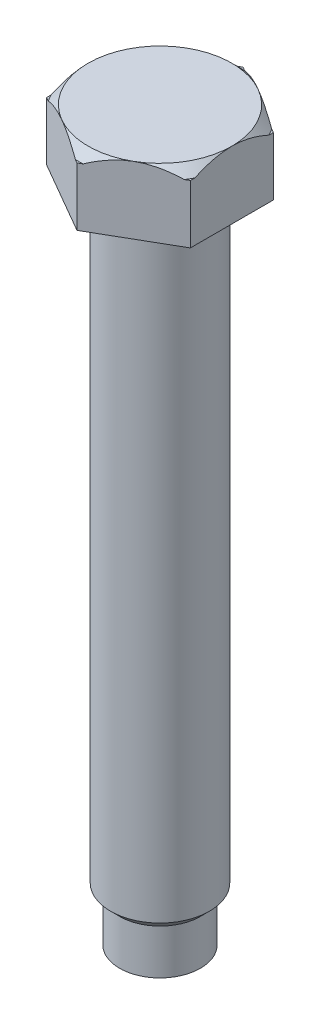
ISO-10303-21;
HEADER;
FILE_DESCRIPTION(('STEP AP214'),'2;1');
FILE_NAME('part.step','',(''),(''),'','','');
FILE_SCHEMA(('AUTOMOTIVE_DESIGN { 1 0 10303 214 1 1 1 1 }'));
ENDSEC;
DATA;
#1=APPLICATION_CONTEXT('core data for automotive mechanical design processes');
#2=APPLICATION_PROTOCOL_DEFINITION('international standard','automotive_design',2000,#1);
#3=PRODUCT_CONTEXT('',#1,'mechanical');
#4=PRODUCT('Part','Part','',(#3));
#5=PRODUCT_RELATED_PRODUCT_CATEGORY('part','',(#4));
#6=PRODUCT_DEFINITION_FORMATION('','',#4);
#7=PRODUCT_DEFINITION_CONTEXT('part definition',#1,'design');
#8=PRODUCT_DEFINITION('design','',#6,#7);
#9=PRODUCT_DEFINITION_SHAPE('','',#8);
#10=(LENGTH_UNIT() NAMED_UNIT(*) SI_UNIT(.MILLI.,.METRE.));
#11=(NAMED_UNIT(*) PLANE_ANGLE_UNIT() SI_UNIT($,.RADIAN.));
#12=(NAMED_UNIT(*) SI_UNIT($,.STERADIAN.) SOLID_ANGLE_UNIT());
#13=UNCERTAINTY_MEASURE_WITH_UNIT(LENGTH_MEASURE(1.E-05),#10,'distance_accuracy_value','');
#14=(GEOMETRIC_REPRESENTATION_CONTEXT(3) GLOBAL_UNCERTAINTY_ASSIGNED_CONTEXT((#13)) GLOBAL_UNIT_ASSIGNED_CONTEXT((#10,
#11,#12)) REPRESENTATION_CONTEXT('',''));
#15=CARTESIAN_POINT('',(0.,0.,0.));
#16=DIRECTION('',(0.,0.,1.));
#17=DIRECTION('',(1.,0.,0.));
#18=AXIS2_PLACEMENT_3D('',#15,#16,#17);
#19=CARTESIAN_POINT('',(-7.99999999999973,81.0000000000001,4.61880215351716));
#20=DIRECTION('',(0.500000000000007,0.,-0.866025403784446));
#21=DIRECTION('',(-0.866025403784441,0.,-0.500000000000008));
#22=AXIS2_PLACEMENT_3D('',#19,#20,#21);
#23=PLANE('',#22);
#24=DIRECTION('',(0.866025403784441,0.,0.500000000000008));
#25=VECTOR('',#24,1.);
#26=CARTESIAN_POINT('',(-7.9999999999997,80.0000000000001,4.61880215351725));
#27=LINE('',#26,#25);
#28=CARTESIAN_POINT('',(-7.9999999999997,80.0000000000001,4.61880215351725));
#29=VERTEX_POINT('',#28);
#30=CARTESIAN_POINT('',(-7.57071421427136,80.0000000000003,4.8666504174669));
#31=VERTEX_POINT('',#30);
#32=EDGE_CURVE('E322',#29,#31,#27,.T.);
#33=ORIENTED_EDGE('',*,*,#32,.F.);
#34=DIRECTION('',(0.,-1.,0.));
#35=VECTOR('',#34,1.);
#36=CARTESIAN_POINT('',(-7.99999999999973,81.0000000000001,4.61880215351716));
#37=LINE('',#36,#35);
#38=CARTESIAN_POINT('',(-7.9999999999997,73.5,4.61880215351713));
#39=VERTEX_POINT('',#38);
#40=EDGE_CURVE('E325',#29,#39,#37,.T.);
#41=ORIENTED_EDGE('',*,*,#40,.T.);
#42=DIRECTION('',(-0.866025403784441,0.,-0.500000000000008));
#43=VECTOR('',#42,1.);
#44=CARTESIAN_POINT('',(-7.9999999999997,73.5,4.61880215351713));
#45=LINE('',#44,#43);
#46=CARTESIAN_POINT('',(0.,73.5000000000003,9.23760430703413));
#47=VERTEX_POINT('',#46);
#48=EDGE_CURVE('E177',#47,#39,#45,.T.);
#49=ORIENTED_EDGE('',*,*,#48,.F.);
#50=DIRECTION('',(0.,-1.,0.));
#51=VECTOR('',#50,1.);
#52=CARTESIAN_POINT('',(1.73472347597681E-13,81.0000000000002,9.23760430703422));
#53=LINE('',#52,#51);
#54=CARTESIAN_POINT('',(1.45716771982052E-13,80.0000000000002,9.23760430703432));
#55=VERTEX_POINT('',#54);
#56=EDGE_CURVE('E336',#55,#47,#53,.T.);
#57=ORIENTED_EDGE('',*,*,#56,.F.);
#58=CARTESIAN_POINT('',(-0.429285785728289,80.0000000000001,8.98975604308469));
#59=VERTEX_POINT('',#58);
#60=EDGE_CURVE('E164',#59,#55,#27,.T.);
#61=ORIENTED_EDGE('',*,*,#60,.F.);
#62=CARTESIAN_POINT('',(-0.429285785728289,80.0000000000001,8.98975604308469));
#63=CARTESIAN_POINT('',(-0.682286805465609,80.1337728251455,8.84368583623399));
#64=CARTESIAN_POINT('',(-0.939258025127098,80.2585346275474,8.6953234333884));
#65=CARTESIAN_POINT('',(-1.46212399221156,80.4847944048711,8.39344662654205));
#66=CARTESIAN_POINT('',(-1.72805585656148,80.5861770626138,8.23991079307354));
#67=CARTESIAN_POINT('',(-2.26073870277772,80.7569039151815,7.9323662084179));
#68=CARTESIAN_POINT('',(-2.52730840505806,80.826975288518,7.77846211904855));
#69=CARTESIAN_POINT('',(-2.93055010378372,80.9066985512022,7.5456504157408));
#70=CARTESIAN_POINT('',(-3.06539864358169,80.9290331205838,7.46779557498862));
#71=CARTESIAN_POINT('',(-3.3359646693368,80.9648339176144,7.31158420718533));
#72=CARTESIAN_POINT('',(-3.47168190825282,80.9783025624827,7.23322782276349));
#73=CARTESIAN_POINT('',(-3.67284367347946,80.9914395801806,7.11708702345922));
#74=CARTESIAN_POINT('',(-3.73812826821683,80.9946421617532,7.07939494511365));
#75=CARTESIAN_POINT('',(-3.86894036946142,80.9989260054341,7.00387054324688));
#76=CARTESIAN_POINT('',(-3.93446802865368,81.0000010463737,6.96603813157293));
#77=CARTESIAN_POINT('',(-3.99999999999986,81.0000000000003,6.92820323027581));
#78=B_SPLINE_CURVE_WITH_KNOTS('',3,(#62,#63,#64,#65,#66,#67,#68,#69,#70,#71,#72,#73,#74,#75,#76,
#77),.UNSPECIFIED.,.F.,.F.,(4,2,2,2,2,2,2,4),(0.,0.964394998266148,1.93344969296791,
2.87865184730712,3.35035632591322,3.82193214495467,4.04826325144662,4.27525520346946),.UNSPECIFIED.);
#79=CARTESIAN_POINT('',(-3.99999999999986,81.0000000000003,6.92820323027581));
#80=VERTEX_POINT('',#79);
#81=EDGE_CURVE('E53',#59,#80,#78,.T.);
#82=ORIENTED_EDGE('',*,*,#81,.T.);
#83=CARTESIAN_POINT('',(-3.99999999999986,81.0000000000003,6.92820323027581));
#84=CARTESIAN_POINT('',(-4.10635011265076,81.0000142434006,6.86680196410833));
#85=CARTESIAN_POINT('',(-4.21269603252121,80.9971727925569,6.80540311864385));
#86=CARTESIAN_POINT('',(-4.42514856169135,80.9858842734961,6.68274359373741));
#87=CARTESIAN_POINT('',(-4.53125520559826,80.9774380760943,6.62148289431496));
#88=CARTESIAN_POINT('',(-4.74285723974113,80.9550641923596,6.49931440294151));
#89=CARTESIAN_POINT('',(-4.84835334837471,80.9411455461956,6.43840619622345));
#90=CARTESIAN_POINT('',(-5.05871742585153,80.9080270678753,6.31695243946438));
#91=CARTESIAN_POINT('',(-5.16358537827151,80.8888270982485,6.25640689890535));
#92=CARTESIAN_POINT('',(-5.47400778458519,80.8242872093339,6.07718443905764));
#93=CARTESIAN_POINT('',(-5.67845027833715,80.7716684314794,5.95914951025612));
#94=CARTESIAN_POINT('',(-6.08340098782148,80.6491669370272,5.72535110912688));
#95=CARTESIAN_POINT('',(-6.2839083411322,80.579280480677,5.60958813471853));
#96=CARTESIAN_POINT('',(-6.57451925737969,80.4660991797363,5.44180384399353));
#97=CARTESIAN_POINT('',(-6.66634142552185,80.4285612681929,5.38879029049903));
#98=CARTESIAN_POINT('',(-6.84902084505205,80.3505513766624,5.28332027845783));
#99=CARTESIAN_POINT('',(-6.93987835307667,80.3100802006602,5.23086367174194));
#100=CARTESIAN_POINT('',(-7.12127600614697,80.2261442700985,5.12613368791143));
#101=CARTESIAN_POINT('',(-7.21180961670289,80.1826607573225,5.07386408348625));
#102=CARTESIAN_POINT('',(-7.3919537205725,80.0931677917638,4.96985783662423));
#103=CARTESIAN_POINT('',(-7.48156406270468,80.0471579328704,4.91812128147209));
#104=CARTESIAN_POINT('',(-7.57071421427136,80.0000000000003,4.8666504174669));
#105=B_SPLINE_CURVE_WITH_KNOTS('',3,(#83,#84,#85,#86,#87,#88,#89,#90,#91,#92,#93,#94,#95,#96,
#97,#98,#99,#100,#101,#102,#103,#104),.UNSPECIFIED.,.F.,.F.,(4,2,2,2,2,2,2,2,2,2,4),(0.,
0.368366709263885,0.7366761984054,1.10437980078994,1.47209297525061,2.196872597049,
2.92180932601098,3.25920304407764,3.59650463236878,3.93613766892016,4.27582546232706),.UNSPECIFIED.);
#106=EDGE_CURVE('E46',#80,#31,#105,.T.);
#107=ORIENTED_EDGE('',*,*,#106,.T.);
#108=EDGE_LOOP('',(#33,#41,#49,#57,#61,#82,#107));
#109=FACE_BOUND('',#108,.T.);
#110=ADVANCED_FACE('F32',(#109),#23,.F.);
#111=CARTESIAN_POINT('',(-7.99999999999985,81.0000000000005,-4.61880215351702));
#112=DIRECTION('',(1.,0.,0.));
#113=DIRECTION('',(0.,0.,-1.00000000000001));
#114=AXIS2_PLACEMENT_3D('',#111,#112,#113);
#115=PLANE('',#114);
#116=DIRECTION('',(0.,0.,1.00000000000001));
#117=VECTOR('',#116,1.);
#118=CARTESIAN_POINT('',(-7.9999999999997,80.0000000000005,-4.61880215351694));
#119=LINE('',#118,#117);
#120=CARTESIAN_POINT('',(-7.9999999999997,80.0000000000005,-4.61880215351694));
#121=VERTEX_POINT('',#120);
#122=CARTESIAN_POINT('',(-7.9999999999999,80.0000000000005,-4.12310562561755));
#123=VERTEX_POINT('',#122);
#124=EDGE_CURVE('E395',#121,#123,#119,.T.);
#125=ORIENTED_EDGE('',*,*,#124,.F.);
#126=DIRECTION('',(0.,-1.,0.));
#127=VECTOR('',#126,1.);
#128=CARTESIAN_POINT('',(-7.99999999999985,81.0000000000005,-4.61880215351702));
#129=LINE('',#128,#127);
#130=CARTESIAN_POINT('',(-7.99999999999994,73.5000000000005,-4.61880215351704));
#131=VERTEX_POINT('',#130);
#132=EDGE_CURVE('E335',#121,#131,#129,.T.);
#133=ORIENTED_EDGE('',*,*,#132,.T.);
#134=DIRECTION('',(0.,0.,-1.00000000000001));
#135=VECTOR('',#134,1.);
#136=CARTESIAN_POINT('',(-7.99999999999994,73.5000000000005,-4.61880215351704));
#137=LINE('',#136,#135);
#138=EDGE_CURVE('E334',#39,#131,#137,.T.);
#139=ORIENTED_EDGE('',*,*,#138,.F.);
#140=ORIENTED_EDGE('',*,*,#40,.F.);
#141=CARTESIAN_POINT('',(-7.9999999999998,80.,4.12310562561783));
#142=VERTEX_POINT('',#141);
#143=EDGE_CURVE('E332',#142,#29,#119,.T.);
#144=ORIENTED_EDGE('',*,*,#143,.F.);
#145=CARTESIAN_POINT('',(-7.9999999999998,80.,4.12310562561783));
#146=CARTESIAN_POINT('',(-7.99999999999985,80.1337728251453,3.8309652119167));
#147=CARTESIAN_POINT('',(-7.99999999999987,80.2585346275472,3.53424040622569));
#148=CARTESIAN_POINT('',(-7.99999999999989,80.4847944048708,2.93048679253288));
#149=CARTESIAN_POINT('',(-7.99999999999989,80.5861770626136,2.62341512559554));
#150=CARTESIAN_POINT('',(-7.99999999999987,80.7569039151815,2.00832595628392));
#151=CARTESIAN_POINT('',(-7.99999999999986,80.8269752885182,1.70051777754519));
#152=CARTESIAN_POINT('',(-7.99999999999989,80.9066985512019,1.23489437092969));
#153=CARTESIAN_POINT('',(-7.9999999999999,80.9290331205833,1.07918468942536));
#154=CARTESIAN_POINT('',(-7.99999999999985,80.9648339176147,0.766761953818992));
#155=CARTESIAN_POINT('',(-7.99999999999977,80.978302562484,0.610049184975482));
#156=CARTESIAN_POINT('',(-7.99999999999981,80.9914395801813,0.377767586367088));
#157=CARTESIAN_POINT('',(-7.99999999999985,80.9946421617533,0.302383429675988));
#158=CARTESIAN_POINT('',(-7.9999999999999,80.9989260054336,0.151334625942423));
#159=CARTESIAN_POINT('',(-7.99999999999991,81.0000010463731,0.0756698025944552));
#160=CARTESIAN_POINT('',(-7.99999999999987,81.0000000000004,0.));
#161=B_SPLINE_CURVE_WITH_KNOTS('',3,(#145,#146,#147,#148,#149,#150,#151,#152,#153,#154,#155,
#156,#157,#158,#159,#160),.UNSPECIFIED.,.F.,.F.,(4,2,2,2,2,2,2,4),(0.,0.964394998265761,
1.93344969296846,2.87865184730778,3.35035632591371,3.82193214495488,4.04826325144669,
4.27525520346939),.UNSPECIFIED.);
#162=CARTESIAN_POINT('',(-7.99999999999987,81.0000000000004,0.));
#163=VERTEX_POINT('',#162);
#164=EDGE_CURVE('E11',#142,#163,#161,.T.);
#165=ORIENTED_EDGE('',*,*,#164,.T.);
#166=CARTESIAN_POINT('',(-7.99999999999987,81.0000000000004,0.));
#167=CARTESIAN_POINT('',(-7.99999999999987,81.0000142434006,-0.122802532334624));
#168=CARTESIAN_POINT('',(-7.99999999999987,80.9971727925568,-0.245600223263466));
#169=CARTESIAN_POINT('',(-7.99999999999987,80.9858842734959,-0.490919273076228));
#170=CARTESIAN_POINT('',(-7.99999999999987,80.9774380760942,-0.613440671921128));
#171=CARTESIAN_POINT('',(-7.99999999999987,80.9550641923595,-0.857777654668048));
#172=CARTESIAN_POINT('',(-7.99999999999987,80.9411455461954,-0.979594068104186));
#173=CARTESIAN_POINT('',(-7.99999999999986,80.9080270678752,-1.22250158162237));
#174=CARTESIAN_POINT('',(-7.99999999999986,80.8888270982484,-1.34359266274048));
#175=CARTESIAN_POINT('',(-7.99999999999988,80.8242872093337,-1.70203758243586));
#176=CARTESIAN_POINT('',(-7.99999999999997,80.7716684314789,-1.93810744003876));
#177=CARTESIAN_POINT('',(-7.99999999999976,80.6491669370275,-2.4057042422975));
#178=CARTESIAN_POINT('',(-7.99999999999946,80.5792804806782,-2.63723019111462));
#179=CARTESIAN_POINT('',(-7.99999999999965,80.466099179737,-2.97279877256424));
#180=CARTESIAN_POINT('',(-7.9999999999998,80.428561268193,-3.07882587955299));
#181=CARTESIAN_POINT('',(-7.99999999999991,80.3505513766622,-3.28976590363521));
#182=CARTESIAN_POINT('',(-7.99999999999988,80.3100802006602,-3.39467911706707));
#183=CARTESIAN_POINT('',(-7.99999999999984,80.2261442700985,-3.60413908472813));
#184=CARTESIAN_POINT('',(-7.99999999999985,80.1826607573224,-3.70867829357847));
#185=CARTESIAN_POINT('',(-7.99999999999987,80.0931677917638,-3.91669078730255));
#186=CARTESIAN_POINT('',(-7.99999999999989,80.0471579328704,-4.02016389760691));
#187=CARTESIAN_POINT('',(-7.9999999999999,80.0000000000005,-4.12310562561755));
#188=B_SPLINE_CURVE_WITH_KNOTS('',3,(#166,#167,#168,#169,#170,#171,#172,#173,#174,#175,#176,
#177,#178,#179,#180,#181,#182,#183,#184,#185,#186,#187),.UNSPECIFIED.,.F.,.F.,(4,2,2,2,2,2,2,2,
2,2,4),(0.,0.368366709263793,0.736676198405256,1.10437980078987,1.47209297525061,
2.19687259704896,2.9218093260108,3.25920304407744,3.59650463236859,3.93613766891999,
4.27582546232688),.UNSPECIFIED.);
#189=EDGE_CURVE('E296',#163,#123,#188,.T.);
#190=ORIENTED_EDGE('',*,*,#189,.T.);
#191=EDGE_LOOP('',(#125,#133,#139,#140,#144,#165,#190));
#192=FACE_BOUND('',#191,.T.);
#193=ADVANCED_FACE('F301',(#192),#115,.F.);
#194=CARTESIAN_POINT('',(2.4980018054066E-13,81.0000000000001,-9.23760430703405));
#195=DIRECTION('',(0.499999999999997,0.,0.866025403784447));
#196=DIRECTION('',(0.866025403784444,0.,-0.5));
#197=AXIS2_PLACEMENT_3D('',#194,#195,#196);
#198=PLANE('',#197);
#199=DIRECTION('',(-0.866025403784444,0.,0.5));
#200=VECTOR('',#199,1.);
#201=CARTESIAN_POINT('',(4.71844785465692E-13,80.0000000000001,-9.23760430703389));
#202=LINE('',#201,#200);
#203=CARTESIAN_POINT('',(4.71844785465692E-13,80.0000000000001,-9.23760430703389));
#204=VERTEX_POINT('',#203);
#205=CARTESIAN_POINT('',(-0.4292857857284,80.0000000000001,-8.9897560430842));
#206=VERTEX_POINT('',#205);
#207=EDGE_CURVE('E347',#204,#206,#202,.T.);
#208=ORIENTED_EDGE('',*,*,#207,.F.);
#209=DIRECTION('',(0.,-1.,0.));
#210=VECTOR('',#209,1.);
#211=CARTESIAN_POINT('',(2.4980018054066E-13,81.0000000000001,-9.23760430703405));
#212=LINE('',#211,#210);
#213=CARTESIAN_POINT('',(1.45716771982052E-13,73.5000000000002,-9.23760430703403));
#214=VERTEX_POINT('',#213);
#215=EDGE_CURVE('E179',#204,#214,#212,.T.);
#216=ORIENTED_EDGE('',*,*,#215,.T.);
#217=DIRECTION('',(0.866025403784444,0.,-0.5));
#218=VECTOR('',#217,1.);
#219=CARTESIAN_POINT('',(1.45716771982052E-13,73.5000000000002,-9.23760430703403));
#220=LINE('',#219,#218);
#221=EDGE_CURVE('E345',#131,#214,#220,.T.);
#222=ORIENTED_EDGE('',*,*,#221,.F.);
#223=ORIENTED_EDGE('',*,*,#132,.F.);
#224=CARTESIAN_POINT('',(-7.57071421427133,80.0000000000004,-4.86665041746657));
#225=VERTEX_POINT('',#224);
#226=EDGE_CURVE('E399',#225,#121,#202,.T.);
#227=ORIENTED_EDGE('',*,*,#226,.F.);
#228=CARTESIAN_POINT('',(-7.57071421427133,80.0000000000004,-4.86665041746657));
#229=CARTESIAN_POINT('',(-7.31771319453401,80.1337728251454,-5.01272062431724));
#230=CARTESIAN_POINT('',(-7.06074197487259,80.2585346275472,-5.16108302716278));
#231=CARTESIAN_POINT('',(-6.53787600778807,80.4847944048707,-5.46295983400915));
#232=CARTESIAN_POINT('',(-6.27194414343802,80.5861770626136,-5.61649566747774));
#233=CARTESIAN_POINT('',(-5.73926129722158,80.7569039151814,-5.92404025213347));
#234=CARTESIAN_POINT('',(-5.47269159494118,80.8269752885181,-6.07794434150284));
#235=CARTESIAN_POINT('',(-5.06944989621547,80.906698551202,-6.31075604481065));
#236=CARTESIAN_POINT('',(-4.93460135641751,80.9290331205834,-6.38861088556285));
#237=CARTESIAN_POINT('',(-4.66403533066244,80.9648339176145,-6.54482225336603));
#238=CARTESIAN_POINT('',(-4.52831809174645,80.9783025624835,-6.62317863778774));
#239=CARTESIAN_POINT('',(-4.32715632651989,80.991439580181,-6.73931943709204));
#240=CARTESIAN_POINT('',(-4.26187173178255,80.9946421617532,-6.77701151543765));
#241=CARTESIAN_POINT('',(-4.13105963053799,80.9989260054338,-6.85253591730444));
#242=CARTESIAN_POINT('',(-4.06553197134573,81.0000010463735,-6.89036832897837));
#243=CARTESIAN_POINT('',(-3.99999999999952,81.0000000000009,-6.92820323027536));
#244=B_SPLINE_CURVE_WITH_KNOTS('',3,(#228,#229,#230,#231,#232,#233,#234,#235,#236,#237,#238,
#239,#240,#241,#242,#243),.UNSPECIFIED.,.F.,.F.,(4,2,2,2,2,2,2,4),(0.,0.964394998265744,
1.93344969296802,2.87865184730744,3.3503563259135,3.82193214495481,4.04826325144671,
4.27525520346949),.UNSPECIFIED.);
#245=CARTESIAN_POINT('',(-3.99999999999952,81.0000000000009,-6.92820323027536));
#246=VERTEX_POINT('',#245);
#247=EDGE_CURVE('E276',#225,#246,#244,.T.);
#248=ORIENTED_EDGE('',*,*,#247,.T.);
#249=CARTESIAN_POINT('',(-3.99999999999952,81.0000000000009,-6.92820323027536));
#250=CARTESIAN_POINT('',(-3.89364988734869,81.0000142434008,-6.98960449644289));
#251=CARTESIAN_POINT('',(-3.78730396747829,80.9971727925568,-7.05100334190738));
#252=CARTESIAN_POINT('',(-3.57485143830821,80.9858842734959,-7.17366286681382));
#253=CARTESIAN_POINT('',(-3.46874479440131,80.9774380760942,-7.23492356623625));
#254=CARTESIAN_POINT('',(-3.25714276025845,80.9550641923596,-7.35709205760968));
#255=CARTESIAN_POINT('',(-3.15164665162487,80.9411455461955,-7.41800026432774));
#256=CARTESIAN_POINT('',(-2.94128257414805,80.9080270678752,-7.53945402108681));
#257=CARTESIAN_POINT('',(-2.83641462172807,80.8888270982485,-7.59999956164585));
#258=CARTESIAN_POINT('',(-2.5259922154144,80.8242872093338,-7.77922202149353));
#259=CARTESIAN_POINT('',(-2.32154972166248,80.7716684314792,-7.89725695029499));
#260=CARTESIAN_POINT('',(-1.91659901217816,80.6491669370274,-8.1310553514243));
#261=CARTESIAN_POINT('',(-1.71609165886741,80.5792804806775,-8.24681832583279));
#262=CARTESIAN_POINT('',(-1.42548074261998,80.4660991797366,-8.41460261655767));
#263=CARTESIAN_POINT('',(-1.33365857447785,80.428561268193,-8.46761617005209));
#264=CARTESIAN_POINT('',(-1.15097915494766,80.3505513766624,-8.57308618209323));
#265=CARTESIAN_POINT('',(-1.06012164692303,80.3100802006603,-8.62554278880915));
#266=CARTESIAN_POINT('',(-0.878723993852707,80.2261442700986,-8.73027277263968));
#267=CARTESIAN_POINT('',(-0.788190383296773,80.1826607573226,-8.78254237706486));
#268=CARTESIAN_POINT('',(-0.608046279427171,80.0931677917639,-8.88654862392687));
#269=CARTESIAN_POINT('',(-0.518435937295018,80.0471579328704,-8.93828517907901));
#270=CARTESIAN_POINT('',(-0.4292857857284,80.0000000000001,-8.9897560430842));
#271=B_SPLINE_CURVE_WITH_KNOTS('',3,(#249,#250,#251,#252,#253,#254,#255,#256,#257,#258,#259,
#260,#261,#262,#263,#264,#265,#266,#267,#268,#269,#270),.UNSPECIFIED.,.F.,.F.,(4,2,2,2,2,2,2,2,
2,2,4),(0.,0.368366709263801,0.736676198405258,1.1043798007898,1.47209297525046,
2.19687259704878,2.92180932601065,3.25920304407732,3.59650463236848,3.93613766891988,
4.27582546232678),.UNSPECIFIED.);
#272=EDGE_CURVE('E235',#246,#206,#271,.T.);
#273=ORIENTED_EDGE('',*,*,#272,.T.);
#274=EDGE_LOOP('',(#208,#216,#222,#223,#227,#248,#273));
#275=FACE_BOUND('',#274,.T.);
#276=ADVANCED_FACE('F304',(#275),#198,.F.);
#277=CARTESIAN_POINT('',(8.00000000000012,80.9999999999997,-4.61880215351676));
#278=DIRECTION('',(-0.500000000000007,0.,0.866025403784446));
#279=DIRECTION('',(0.866025403784441,0.,0.500000000000008));
#280=AXIS2_PLACEMENT_3D('',#277,#278,#279);
#281=PLANE('',#280);
#282=DIRECTION('',(-0.866025403784441,0.,-0.500000000000008));
#283=VECTOR('',#282,1.);
#284=CARTESIAN_POINT('',(8.00000000000001,79.9999999999997,-4.61880215351668));
#285=LINE('',#284,#283);
#286=CARTESIAN_POINT('',(8.00000000000001,79.9999999999997,-4.61880215351668));
#287=VERTEX_POINT('',#286);
#288=CARTESIAN_POINT('',(7.57071421427145,79.9999999999997,-4.86665041746659));
#289=VERTEX_POINT('',#288);
#290=EDGE_CURVE('E403',#287,#289,#285,.T.);
#291=ORIENTED_EDGE('',*,*,#290,.F.);
#292=DIRECTION('',(0.,-1.,0.));
#293=VECTOR('',#292,1.);
#294=CARTESIAN_POINT('',(8.00000000000012,80.9999999999997,-4.61880215351676));
#295=LINE('',#294,#293);
#296=CARTESIAN_POINT('',(8.00000000000004,73.4999999999996,-4.61880215351679));
#297=VERTEX_POINT('',#296);
#298=EDGE_CURVE('E174',#287,#297,#295,.T.);
#299=ORIENTED_EDGE('',*,*,#298,.T.);
#300=DIRECTION('',(0.866025403784441,0.,0.500000000000008));
#301=VECTOR('',#300,1.);
#302=CARTESIAN_POINT('',(8.00000000000004,73.4999999999996,-4.61880215351679));
#303=LINE('',#302,#301);
#304=EDGE_CURVE('E353',#214,#297,#303,.T.);
#305=ORIENTED_EDGE('',*,*,#304,.F.);
#306=ORIENTED_EDGE('',*,*,#215,.F.);
#307=CARTESIAN_POINT('',(0.4292857857289,79.9999999999998,-8.98975604308407));
#308=VERTEX_POINT('',#307);
#309=EDGE_CURVE('E400',#308,#204,#285,.T.);
#310=ORIENTED_EDGE('',*,*,#309,.F.);
#311=CARTESIAN_POINT('',(0.4292857857289,79.9999999999998,-8.98975604308407));
#312=CARTESIAN_POINT('',(0.682286805466248,80.1337728251455,-8.84368583623343));
#313=CARTESIAN_POINT('',(0.939258025127814,80.2585346275477,-8.69532343338781));
#314=CARTESIAN_POINT('',(1.46212399221236,80.4847944048715,-8.39344662654142));
#315=CARTESIAN_POINT('',(1.7280558565623,80.5861770626143,-8.23991079307288));
#316=CARTESIAN_POINT('',(2.2607387027785,80.7569039151819,-7.9323662084173));
#317=CARTESIAN_POINT('',(2.52730840505878,80.8269752885183,-7.778462119048));
#318=CARTESIAN_POINT('',(2.93055010378432,80.9066985512026,-7.54565041574026));
#319=CARTESIAN_POINT('',(3.06539864358225,80.9290331205843,-7.46779557498805));
#320=CARTESIAN_POINT('',(3.33596466933742,80.9648339176147,-7.31158420718488));
#321=CARTESIAN_POINT('',(3.47168190825353,80.9783025624827,-7.23322782276316));
#322=CARTESIAN_POINT('',(3.67284367348006,80.9914395801808,-7.11708702345885));
#323=CARTESIAN_POINT('',(3.73812826821733,80.9946421617536,-7.07939494511326));
#324=CARTESIAN_POINT('',(3.86894036946175,80.9989260054345,-7.00387054324646));
#325=CARTESIAN_POINT('',(3.93446802865394,81.0000010463738,-6.96603813157251));
#326=CARTESIAN_POINT('',(4.00000000000011,80.9999999999997,-6.92820323027548));
#327=B_SPLINE_CURVE_WITH_KNOTS('',3,(#311,#312,#313,#314,#315,#316,#317,#318,#319,#320,#321,
#322,#323,#324,#325,#326),.UNSPECIFIED.,.F.,.F.,(4,2,2,2,2,2,2,4),(0.,0.964394998266605,
1.93344969296838,2.87865184730735,3.3503563259134,3.82193214495485,4.04826325144659,
4.27525520346924),.UNSPECIFIED.);
#328=CARTESIAN_POINT('',(4.00000000000011,80.9999999999997,-6.92820323027548));
#329=VERTEX_POINT('',#328);
#330=EDGE_CURVE('E241',#308,#329,#327,.T.);
#331=ORIENTED_EDGE('',*,*,#330,.T.);
#332=CARTESIAN_POINT('',(4.00000000000011,80.9999999999997,-6.92820323027548));
#333=CARTESIAN_POINT('',(4.10635011265103,81.0000142434007,-6.86680196410799));
#334=CARTESIAN_POINT('',(4.2126960325215,80.9971727925572,-6.80540311864351));
#335=CARTESIAN_POINT('',(4.42514856169165,80.9858842734966,-6.68274359373707));
#336=CARTESIAN_POINT('',(4.53125520559856,80.9774380760948,-6.62148289431462));
#337=CARTESIAN_POINT('',(4.74285723974146,80.95506419236,-6.49931440294115));
#338=CARTESIAN_POINT('',(4.84835334837505,80.941145546196,-6.43840619622308));
#339=CARTESIAN_POINT('',(5.05871742585191,80.9080270678758,-6.31695243946399));
#340=CARTESIAN_POINT('',(5.16358537827192,80.888827098249,-6.25640689890494));
#341=CARTESIAN_POINT('',(5.47400778458556,80.8242872093343,-6.07718443905725));
#342=CARTESIAN_POINT('',(5.67845027833741,80.7716684314796,-5.95914951025577));
#343=CARTESIAN_POINT('',(6.08340098782182,80.649166937028,-5.72535110912654));
#344=CARTESIAN_POINT('',(6.28390834113273,80.5792804806785,-5.60958813471817));
#345=CARTESIAN_POINT('',(6.57451925738003,80.4660991797374,-5.44180384399323));
#346=CARTESIAN_POINT('',(6.66634142552208,80.4285612681936,-5.38879029049874));
#347=CARTESIAN_POINT('',(6.84902084505223,80.3505513766628,-5.28332027845754));
#348=CARTESIAN_POINT('',(6.9398783530769,80.3100802006607,-5.23086367174162));
#349=CARTESIAN_POINT('',(7.12127600614732,80.2261442700991,-5.12613368791106));
#350=CARTESIAN_POINT('',(7.21180961670331,80.182660757323,-5.07386408348585));
#351=CARTESIAN_POINT('',(7.3919537205729,80.0931677917642,-4.96985783662382));
#352=CARTESIAN_POINT('',(7.48156406270499,80.0471579328705,-4.9181212814717));
#353=CARTESIAN_POINT('',(7.57071421427145,79.9999999999997,-4.86665041746659));
#354=B_SPLINE_CURVE_WITH_KNOTS('',3,(#332,#333,#334,#335,#336,#337,#338,#339,#340,#341,#342,
#343,#344,#345,#346,#347,#348,#349,#350,#351,#352,#353),.UNSPECIFIED.,.F.,.F.,(4,2,2,2,2,2,2,2,
2,2,4),(0.,0.368366709263903,0.736676198405436,1.10437980079004,1.47209297525078,
2.19687259704903,2.92180932601081,3.25920304407757,3.59650463236881,3.93613766892034,
4.27582546232737),.UNSPECIFIED.);
#355=EDGE_CURVE('E199',#329,#289,#354,.T.);
#356=ORIENTED_EDGE('',*,*,#355,.T.);
#357=EDGE_LOOP('',(#291,#299,#305,#306,#310,#331,#356));
#358=FACE_BOUND('',#357,.T.);
#359=ADVANCED_FACE('F214',(#358),#281,.F.);
#360=CARTESIAN_POINT('',(8.0000000000004,80.9999999999998,4.61880215351736));
#361=DIRECTION('',(-1.,0.,0.));
#362=DIRECTION('',(0.,0.,1.00000000000001));
#363=AXIS2_PLACEMENT_3D('',#360,#361,#362);
#364=PLANE('',#363);
#365=DIRECTION('',(0.,0.,-1.00000000000001));
#366=VECTOR('',#365,1.);
#367=CARTESIAN_POINT('',(8.00000000000043,79.9999999999998,4.61880215351735));
#368=LINE('',#367,#366);
#369=CARTESIAN_POINT('',(8.00000000000043,79.9999999999998,4.61880215351735));
#370=VERTEX_POINT('',#369);
#371=CARTESIAN_POINT('',(8.00000000000033,79.9999999999998,4.12310562561807));
#372=VERTEX_POINT('',#371);
#373=EDGE_CURVE('E148',#370,#372,#368,.T.);
#374=ORIENTED_EDGE('',*,*,#373,.F.);
#375=DIRECTION('',(0.,-1.,0.));
#376=VECTOR('',#375,1.);
#377=CARTESIAN_POINT('',(8.0000000000004,80.9999999999998,4.61880215351736));
#378=LINE('',#377,#376);
#379=CARTESIAN_POINT('',(8.00000000000023,73.4999999999998,4.61880215351727));
#380=VERTEX_POINT('',#379);
#381=EDGE_CURVE('E160',#370,#380,#378,.T.);
#382=ORIENTED_EDGE('',*,*,#381,.T.);
#383=DIRECTION('',(0.,0.,1.00000000000001));
#384=VECTOR('',#383,1.);
#385=CARTESIAN_POINT('',(8.00000000000023,73.4999999999998,4.61880215351727));
#386=LINE('',#385,#384);
#387=EDGE_CURVE('E357',#297,#380,#386,.T.);
#388=ORIENTED_EDGE('',*,*,#387,.F.);
#389=ORIENTED_EDGE('',*,*,#298,.F.);
#390=CARTESIAN_POINT('',(8.00000000000033,79.9999999999999,-4.12310562561749));
#391=VERTEX_POINT('',#390);
#392=EDGE_CURVE('E167',#391,#287,#368,.T.);
#393=ORIENTED_EDGE('',*,*,#392,.F.);
#394=CARTESIAN_POINT('',(8.00000000000033,79.9999999999999,-4.12310562561749));
#395=CARTESIAN_POINT('',(8.00000000000039,80.1337728251455,-3.83096521191627));
#396=CARTESIAN_POINT('',(8.00000000000042,80.2585346275475,-3.53424040622514));
#397=CARTESIAN_POINT('',(8.00000000000043,80.4847944048712,-2.93048679253246));
#398=CARTESIAN_POINT('',(8.00000000000042,80.586177062614,-2.62341512559539));
#399=CARTESIAN_POINT('',(8.00000000000042,80.7569039151816,-2.00832595628409));
#400=CARTESIAN_POINT('',(8.00000000000042,80.8269752885182,-1.70051777754538));
#401=CARTESIAN_POINT('',(8.00000000000041,80.9066985512023,-1.23489437092989));
#402=CARTESIAN_POINT('',(8.00000000000041,80.929033120584,-1.07918468942552));
#403=CARTESIAN_POINT('',(8.00000000000042,80.9648339176145,-0.766761953818939));
#404=CARTESIAN_POINT('',(8.00000000000042,80.9783025624827,-0.610049184975249));
#405=CARTESIAN_POINT('',(8.00000000000042,80.9914395801807,-0.377767586366747));
#406=CARTESIAN_POINT('',(8.00000000000042,80.9946421617533,-0.302383429675654));
#407=CARTESIAN_POINT('',(8.0000000000004,80.9989260054343,-0.151334625942085));
#408=CARTESIAN_POINT('',(8.00000000000038,81.0000010463738,-0.0756698025941082));
#409=CARTESIAN_POINT('',(8.00000000000035,81.0000000000002,2.98372437868011E-13));
#410=B_SPLINE_CURVE_WITH_KNOTS('',3,(#394,#395,#396,#397,#398,#399,#400,#401,#402,#403,#404,
#405,#406,#407,#408,#409),.UNSPECIFIED.,.F.,.F.,(4,2,2,2,2,2,2,4),(0.,0.964394998266321,
1.93344969296812,2.87865184730734,3.35035632591345,3.82193214495492,4.04826325144679,
4.27525520346955),.UNSPECIFIED.);
#411=CARTESIAN_POINT('',(8.00000000000035,81.0000000000002,2.98372437868011E-13));
#412=VERTEX_POINT('',#411);
#413=EDGE_CURVE('E207',#391,#412,#410,.T.);
#414=ORIENTED_EDGE('',*,*,#413,.T.);
#415=CARTESIAN_POINT('',(8.00000000000035,81.0000000000002,2.98372437868011E-13));
#416=CARTESIAN_POINT('',(8.00000000000039,81.0000142434007,0.122802532335047));
#417=CARTESIAN_POINT('',(8.0000000000004,80.997172792557,0.245600223263912));
#418=CARTESIAN_POINT('',(8.00000000000042,80.9858842734963,0.490919273076707));
#419=CARTESIAN_POINT('',(8.00000000000041,80.9774380760945,0.613440671921617));
#420=CARTESIAN_POINT('',(8.00000000000041,80.9550641923597,0.857777654668541));
#421=CARTESIAN_POINT('',(8.00000000000041,80.9411455461957,0.979594068104671));
#422=CARTESIAN_POINT('',(8.00000000000041,80.9080270678755,1.22250158162284));
#423=CARTESIAN_POINT('',(8.00000000000041,80.8888270982487,1.34359266274094));
#424=CARTESIAN_POINT('',(8.00000000000041,80.824287209334,1.70203758243631));
#425=CARTESIAN_POINT('',(8.00000000000041,80.7716684314793,1.93810744003922));
#426=CARTESIAN_POINT('',(8.0000000000004,80.6491669370276,2.40570424229787));
#427=CARTESIAN_POINT('',(8.00000000000039,80.579280480678,2.63723019111488));
#428=CARTESIAN_POINT('',(8.0000000000004,80.466099179737,2.97279877256461));
#429=CARTESIAN_POINT('',(8.0000000000004,80.4285612681932,3.07882587955345));
#430=CARTESIAN_POINT('',(8.0000000000004,80.3505513766624,3.28976590363577));
#431=CARTESIAN_POINT('',(8.0000000000004,80.3100802006603,3.39467911706764));
#432=CARTESIAN_POINT('',(8.0000000000004,80.2261442700986,3.60413908472876));
#433=CARTESIAN_POINT('',(8.00000000000041,80.1826607573226,3.70867829357916));
#434=CARTESIAN_POINT('',(8.00000000000039,80.0931677917638,3.91669078730326));
#435=CARTESIAN_POINT('',(8.00000000000037,80.0471579328702,4.02016389760758));
#436=CARTESIAN_POINT('',(8.00000000000033,79.9999999999998,4.12310562561807));
#437=B_SPLINE_CURVE_WITH_KNOTS('',3,(#415,#416,#417,#418,#419,#420,#421,#422,#423,#424,#425,
#426,#427,#428,#429,#430,#431,#432,#433,#434,#435,#436),.UNSPECIFIED.,.F.,.F.,(4,2,2,2,2,2,2,2,
2,2,4),(0.,0.368366709263853,0.736676198405352,1.10437980078994,1.47209297525066,
2.19687259704896,2.9218093260108,3.25920304407756,3.5965046323688,3.93613766892032,
4.27582546232733),.UNSPECIFIED.);
#438=EDGE_CURVE('E163',#412,#372,#437,.T.);
#439=ORIENTED_EDGE('',*,*,#438,.T.);
#440=EDGE_LOOP('',(#374,#382,#388,#389,#393,#414,#439));
#441=FACE_BOUND('',#440,.T.);
#442=ADVANCED_FACE('F158',(#441),#364,.F.);
#443=CARTESIAN_POINT('',(1.73472347597681E-13,81.0000000000002,9.23760430703422));
#444=DIRECTION('',(-0.499999999999997,0.,-0.866025403784447));
#445=DIRECTION('',(-0.866025403784444,0.,0.5));
#446=AXIS2_PLACEMENT_3D('',#443,#444,#445);
#447=PLANE('',#446);
#448=DIRECTION('',(0.866025403784444,0.,-0.5));
#449=VECTOR('',#448,1.);
#450=CARTESIAN_POINT('',(1.45716771982052E-13,80.0000000000002,9.23760430703432));
#451=LINE('',#450,#449);
#452=CARTESIAN_POINT('',(0.42928578572865,80.0000000000005,8.98975604308472));
#453=VERTEX_POINT('',#452);
#454=EDGE_CURVE('E154',#55,#453,#451,.T.);
#455=ORIENTED_EDGE('',*,*,#454,.F.);
#456=ORIENTED_EDGE('',*,*,#56,.T.);
#457=DIRECTION('',(-0.866025403784444,0.,0.5));
#458=VECTOR('',#457,1.);
#459=CARTESIAN_POINT('',(0.,73.5000000000003,9.23760430703413));
#460=LINE('',#459,#458);
#461=EDGE_CURVE('E172',#380,#47,#460,.T.);
#462=ORIENTED_EDGE('',*,*,#461,.F.);
#463=ORIENTED_EDGE('',*,*,#381,.F.);
#464=CARTESIAN_POINT('',(7.57071421427161,80.0000000000002,4.86665041746697));
#465=VERTEX_POINT('',#464);
#466=EDGE_CURVE('E145',#465,#370,#451,.T.);
#467=ORIENTED_EDGE('',*,*,#466,.F.);
#468=CARTESIAN_POINT('',(7.57071421427186,80.0000000000001,4.86665041746702));
#469=CARTESIAN_POINT('',(7.31771319453437,80.1337728251456,5.01272062431756));
#470=CARTESIAN_POINT('',(7.06074197487277,80.2585346275476,5.16108302716312));
#471=CARTESIAN_POINT('',(6.53787600778815,80.4847944048713,5.46295983400948));
#472=CARTESIAN_POINT('',(6.27194414343819,80.5861770626141,5.61649566747804));
#473=CARTESIAN_POINT('',(5.73926129722194,80.7569039151817,5.92404025213369));
#474=CARTESIAN_POINT('',(5.47269159494163,80.8269752885182,6.07794434150301));
#475=CARTESIAN_POINT('',(5.06944989621603,80.9066985512024,6.31075604481073));
#476=CARTESIAN_POINT('',(4.93460135641808,80.929033120584,6.38861088556291));
#477=CARTESIAN_POINT('',(4.66403533066297,80.9648339176145,6.54482225336616));
#478=CARTESIAN_POINT('',(4.52831809174693,80.9783025624827,6.62317863778796));
#479=CARTESIAN_POINT('',(4.32715632652035,80.9914395801807,6.7393194370922));
#480=CARTESIAN_POINT('',(4.26187173178304,80.9946421617533,6.77701151543774));
#481=CARTESIAN_POINT('',(4.1310596305386,80.9989260054342,6.85253591730454));
#482=CARTESIAN_POINT('',(4.06553197134643,81.0000010463736,6.89036832897854));
#483=CARTESIAN_POINT('',(4.00000000000037,80.9999999999997,6.92820323027578));
#484=B_SPLINE_CURVE_WITH_KNOTS('',3,(#468,#469,#470,#471,#472,#473,#474,#475,#476,#477,#478,
#479,#480,#481,#482,#483),.UNSPECIFIED.,.F.,.F.,(4,2,2,2,2,2,2,4),(0.,0.964394998266464,
1.93344969296837,2.87865184730745,3.3503563259135,3.82193214495493,4.04826325144669,
4.27525520346936),.UNSPECIFIED.);
#485=CARTESIAN_POINT('',(4.00000000000037,80.9999999999997,6.92820323027578));
#486=VERTEX_POINT('',#485);
#487=EDGE_CURVE('E252',#465,#486,#484,.T.);
#488=ORIENTED_EDGE('',*,*,#487,.T.);
#489=CARTESIAN_POINT('',(4.00000000000037,80.9999999999997,6.92820323027578));
#490=CARTESIAN_POINT('',(3.89364988734937,81.0000142434005,6.9896044964431));
#491=CARTESIAN_POINT('',(3.78730396747887,80.997172792557,7.05100334190751));
#492=CARTESIAN_POINT('',(3.5748514383087,80.9858842734963,7.17366286681389));
#493=CARTESIAN_POINT('',(3.46874479440181,80.9774380760945,7.23492356623635));
#494=CARTESIAN_POINT('',(3.25714276025893,80.9550641923597,7.35709205760982));
#495=CARTESIAN_POINT('',(3.15164665162533,80.9411455461957,7.41800026432789));
#496=CARTESIAN_POINT('',(2.94128257414848,80.9080270678755,7.53945402108697));
#497=CARTESIAN_POINT('',(2.83641462172848,80.8888270982487,7.59999956164601));
#498=CARTESIAN_POINT('',(2.52599221541481,80.824287209334,7.77922202149372));
#499=CARTESIAN_POINT('',(2.32154972166291,80.7716684314793,7.89725695029521));
#500=CARTESIAN_POINT('',(1.9165990121785,80.6491669370276,8.13105535142446));
#501=CARTESIAN_POINT('',(1.71609165886761,80.5792804806779,8.24681832583286));
#502=CARTESIAN_POINT('',(1.42548074262027,80.4660991797369,8.41460261655779));
#503=CARTESIAN_POINT('',(1.3336585744782,80.4285612681931,8.46761617005227));
#504=CARTESIAN_POINT('',(1.15097915494805,80.3505513766625,8.57308618209345));
#505=CARTESIAN_POINT('',(1.06012164692339,80.3100802006603,8.62554278880937));
#506=CARTESIAN_POINT('',(0.878723993853033,80.2261442700986,8.73027277263989));
#507=CARTESIAN_POINT('',(0.788190383297093,80.1826607573226,8.78254237706506));
#508=CARTESIAN_POINT('',(0.608046279427471,80.0931677917639,8.88654862392714));
#509=CARTESIAN_POINT('',(0.518435937295305,80.0471579328705,8.93828517907935));
#510=CARTESIAN_POINT('',(0.42928578572865,80.0000000000005,8.98975604308472));
#511=B_SPLINE_CURVE_WITH_KNOTS('',3,(#489,#490,#491,#492,#493,#494,#495,#496,#497,#498,#499,
#500,#501,#502,#503,#504,#505,#506,#507,#508,#509,#510),.UNSPECIFIED.,.F.,.F.,(4,2,2,2,2,2,2,2,
2,2,4),(0.,0.368366709263881,0.736676198405393,1.10437980078998,1.47209297525071,
2.19687259704906,2.92180932601093,3.25920304407764,3.59650463236883,3.93613766892028,
4.27582546232723),.UNSPECIFIED.);
#512=EDGE_CURVE('E269',#486,#453,#511,.T.);
#513=ORIENTED_EDGE('',*,*,#512,.T.);
#514=EDGE_LOOP('',(#455,#456,#462,#463,#467,#488,#513));
#515=FACE_BOUND('',#514,.T.);
#516=ADVANCED_FACE('F170',(#515),#447,.F.);
#517=CARTESIAN_POINT('',(1.87350135405495E-13,73.0000000000002,1.52655665885959E-13));
#518=DIRECTION('',(0.,-1.,0.));
#519=DIRECTION('',(0.,0.,-1.00000000000001));
#520=AXIS2_PLACEMENT_3D('',#517,#518,#519);
#521=CYLINDRICAL_SURFACE('',#520,5.5);
#522=CARTESIAN_POINT('',(2.4980018054066E-13,5.99999999999999,0.));
#523=DIRECTION('',(0.,-1.,0.));
#524=DIRECTION('',(0.,0.,-1.00000000000001));
#525=AXIS2_PLACEMENT_3D('',#522,#523,#524);
#526=CIRCLE('',#525,5.5);
#527=CARTESIAN_POINT('',(2.51021425867748E-13,5.99999999999999,-5.5));
#528=VERTEX_POINT('',#527);
#529=EDGE_CURVE('E155',#528,#528,#526,.F.);
#530=ORIENTED_EDGE('',*,*,#529,.T.);
#531=EDGE_LOOP('',(#530));
#532=FACE_BOUND('',#531,.T.);
#533=CARTESIAN_POINT('',(1.87350135405495E-13,73.0000000000002,1.52655665885959E-13));
#534=DIRECTION('',(0.,1.,0.));
#535=DIRECTION('',(0.,0.,1.00000000000001));
#536=AXIS2_PLACEMENT_3D('',#533,#534,#535);
#537=CIRCLE('',#536,5.5);
#538=CARTESIAN_POINT('',(1.86128890078407E-13,73.0000000000002,5.5000000000002));
#539=VERTEX_POINT('',#538);
#540=EDGE_CURVE('E173',#539,#539,#537,.T.);
#541=ORIENTED_EDGE('',*,*,#540,.F.);
#542=EDGE_LOOP('',(#541));
#543=FACE_BOUND('',#542,.T.);
#544=ADVANCED_FACE('F265',(#532,#543),#521,.T.);
#545=CARTESIAN_POINT('',(8.0000000000004,72.9999999999999,4.61880215351742));
#546=DIRECTION('',(0.,1.,0.));
#547=DIRECTION('',(0.,0.,1.00000000000001));
#548=AXIS2_PLACEMENT_3D('',#545,#546,#547);
#549=PLANE('',#548);
#550=ORIENTED_EDGE('',*,*,#540,.T.);
#551=EDGE_LOOP('',(#550));
#552=FACE_BOUND('',#551,.T.);
#553=CARTESIAN_POINT('',(1.87350135405495E-13,73.0000000000002,1.52655665885959E-13));
#554=DIRECTION('',(0.,-1.,0.));
#555=DIRECTION('',(0.,0.,-1.00000000000001));
#556=AXIS2_PLACEMENT_3D('',#553,#554,#555);
#557=CIRCLE('',#556,7.);
#558=CARTESIAN_POINT('',(1.8890444763997E-13,73.0000000000002,-6.99999999999991));
#559=VERTEX_POINT('',#558);
#560=EDGE_CURVE('E409',#559,#559,#557,.T.);
#561=ORIENTED_EDGE('',*,*,#560,.T.);
#562=EDGE_LOOP('',(#561));
#563=FACE_BOUND('',#562,.T.);
#564=ADVANCED_FACE('F419',(#552,#563),#549,.F.);
#565=CARTESIAN_POINT('',(4.78783679369599E-13,73.5000000000001,0.));
#566=DIRECTION('',(0.,-1.,0.));
#567=DIRECTION('',(0.,0.,-1.00000000000001));
#568=AXIS2_PLACEMENT_3D('',#565,#566,#567);
#569=PLANE('',#568);
#570=CARTESIAN_POINT('',(4.78783679369599E-13,73.5000000000001,0.));
#571=DIRECTION('',(0.,-1.,0.));
#572=DIRECTION('',(0.,0.,-1.00000000000001));
#573=AXIS2_PLACEMENT_3D('',#570,#571,#572);
#574=CIRCLE('',#573,7.);
#575=CARTESIAN_POINT('',(4.80337991604074E-13,73.5000000000001,-7.00000000000009));
#576=VERTEX_POINT('',#575);
#577=EDGE_CURVE('E413',#576,#576,#574,.T.);
#578=ORIENTED_EDGE('',*,*,#577,.F.);
#579=EDGE_LOOP('',(#578));
#580=FACE_BOUND('',#579,.T.);
#581=ORIENTED_EDGE('',*,*,#461,.T.);
#582=ORIENTED_EDGE('',*,*,#48,.T.);
#583=ORIENTED_EDGE('',*,*,#138,.T.);
#584=ORIENTED_EDGE('',*,*,#221,.T.);
#585=ORIENTED_EDGE('',*,*,#304,.T.);
#586=ORIENTED_EDGE('',*,*,#387,.T.);
#587=EDGE_LOOP('',(#581,#582,#583,#584,#585,#586));
#588=FACE_BOUND('',#587,.T.);
#589=ADVANCED_FACE('F352',(#580,#588),#569,.T.);
#590=CARTESIAN_POINT('',(4.78783679369599E-13,73.5000000000001,0.));
#591=DIRECTION('',(0.,-1.,0.));
#592=DIRECTION('',(0.,0.,-1.00000000000001));
#593=AXIS2_PLACEMENT_3D('',#590,#591,#592);
#594=CYLINDRICAL_SURFACE('',#593,7.);
#595=ORIENTED_EDGE('',*,*,#577,.T.);
#596=EDGE_LOOP('',(#595));
#597=FACE_BOUND('',#596,.T.);
#598=ORIENTED_EDGE('',*,*,#560,.F.);
#599=EDGE_LOOP('',(#598));
#600=FACE_BOUND('',#599,.T.);
#601=ADVANCED_FACE('F421',(#597,#600),#594,.T.);
#602=CARTESIAN_POINT('',(0.,5.,1.11022302462516E-13));
#603=DIRECTION('',(0.,-1.,0.));
#604=DIRECTION('',(0.,0.,-1.00000000000001));
#605=AXIS2_PLACEMENT_3D('',#602,#603,#604);
#606=CYLINDRICAL_SURFACE('',#605,4.5);
#607=CARTESIAN_POINT('',(0.,5.,1.11022302462516E-13));
#608=DIRECTION('',(0.,-1.,0.));
#609=DIRECTION('',(0.,0.,-1.00000000000001));
#610=AXIS2_PLACEMENT_3D('',#607,#608,#609);
#611=CIRCLE('',#610,4.5);
#612=CARTESIAN_POINT('',(0.,5.,-4.49999999999993));
#613=VERTEX_POINT('',#612);
#614=EDGE_CURVE('E406',#613,#613,#611,.T.);
#615=ORIENTED_EDGE('',*,*,#614,.T.);
#616=EDGE_LOOP('',(#615));
#617=FACE_BOUND('',#616,.T.);
#618=CARTESIAN_POINT('',(0.,0.,0.));
#619=DIRECTION('',(0.,-1.,0.));
#620=DIRECTION('',(0.,0.,-1.00000000000001));
#621=AXIS2_PLACEMENT_3D('',#618,#619,#620);
#622=CIRCLE('',#621,4.5);
#623=CARTESIAN_POINT('',(0.,0.,-4.50000000000004));
#624=VERTEX_POINT('',#623);
#625=EDGE_CURVE('E410',#624,#624,#622,.T.);
#626=ORIENTED_EDGE('',*,*,#625,.F.);
#627=EDGE_LOOP('',(#626));
#628=FACE_BOUND('',#627,.T.);
#629=ADVANCED_FACE('F423',(#617,#628),#606,.T.);
#630=CARTESIAN_POINT('',(0.,0.,0.));
#631=DIRECTION('',(0.,1.,0.));
#632=DIRECTION('',(0.,0.,1.00000000000001));
#633=AXIS2_PLACEMENT_3D('',#630,#631,#632);
#634=PLANE('',#633);
#635=ORIENTED_EDGE('',*,*,#625,.T.);
#636=EDGE_LOOP('',(#635));
#637=FACE_BOUND('',#636,.T.);
#638=ADVANCED_FACE('F266',(#637),#634,.F.);
#639=CARTESIAN_POINT('',(0.,5.,1.11022302462516E-13));
#640=DIRECTION('',(0.,1.,0.));
#641=DIRECTION('',(0.,0.,1.00000000000001));
#642=AXIS2_PLACEMENT_3D('',#639,#640,#641);
#643=CONICAL_SURFACE('',#642,4.49999999999998,0.785398163397456);
#644=ORIENTED_EDGE('',*,*,#529,.F.);
#645=EDGE_LOOP('',(#644));
#646=FACE_BOUND('',#645,.T.);
#647=ORIENTED_EDGE('',*,*,#614,.F.);
#648=EDGE_LOOP('',(#647));
#649=FACE_BOUND('',#648,.T.);
#650=ADVANCED_FACE('F224',(#646,#649),#643,.T.);
#651=CARTESIAN_POINT('',(0.,80.0000000000002,0.));
#652=DIRECTION('',(0.,1.,0.));
#653=DIRECTION('',(0.,0.,1.00000000000001));
#654=AXIS2_PLACEMENT_3D('',#651,#652,#653);
#655=PLANE('',#654);
#656=ORIENTED_EDGE('',*,*,#207,.T.);
#657=CARTESIAN_POINT('',(0.,80.0000000000002,0.));
#658=DIRECTION('',(0.,1.,0.));
#659=DIRECTION('',(0.,0.,1.00000000000001));
#660=AXIS2_PLACEMENT_3D('',#657,#658,#659);
#661=CIRCLE('',#660,9.);
#662=EDGE_CURVE('E190',#206,#308,#661,.F.);
#663=ORIENTED_EDGE('',*,*,#662,.T.);
#664=ORIENTED_EDGE('',*,*,#309,.T.);
#665=EDGE_LOOP('',(#656,#663,#664));
#666=FACE_BOUND('',#665,.T.);
#667=ADVANCED_FACE('F451',(#666),#655,.T.);
#668=ORIENTED_EDGE('',*,*,#124,.T.);
#669=CARTESIAN_POINT('',(0.,80.0000000000002,0.));
#670=DIRECTION('',(0.,1.,0.));
#671=DIRECTION('',(0.,0.,1.00000000000001));
#672=AXIS2_PLACEMENT_3D('',#669,#670,#671);
#673=CIRCLE('',#672,8.99999999999999);
#674=EDGE_CURVE('E193',#123,#225,#673,.F.);
#675=ORIENTED_EDGE('',*,*,#674,.T.);
#676=ORIENTED_EDGE('',*,*,#226,.T.);
#677=EDGE_LOOP('',(#668,#675,#676));
#678=FACE_BOUND('',#677,.T.);
#679=ADVANCED_FACE('F397',(#678),#655,.T.);
#680=ORIENTED_EDGE('',*,*,#32,.T.);
#681=CARTESIAN_POINT('',(0.,80.0000000000002,0.));
#682=DIRECTION('',(0.,1.,0.));
#683=DIRECTION('',(0.,0.,1.00000000000001));
#684=AXIS2_PLACEMENT_3D('',#681,#682,#683);
#685=CIRCLE('',#684,9.);
#686=EDGE_CURVE('E197',#31,#142,#685,.F.);
#687=ORIENTED_EDGE('',*,*,#686,.T.);
#688=ORIENTED_EDGE('',*,*,#143,.T.);
#689=EDGE_LOOP('',(#680,#687,#688));
#690=FACE_BOUND('',#689,.T.);
#691=ADVANCED_FACE('F477',(#690),#655,.T.);
#692=ORIENTED_EDGE('',*,*,#290,.T.);
#693=CARTESIAN_POINT('',(0.,80.0000000000002,0.));
#694=DIRECTION('',(0.,1.,0.));
#695=DIRECTION('',(0.,0.,1.00000000000001));
#696=AXIS2_PLACEMENT_3D('',#693,#694,#695);
#697=CIRCLE('',#696,8.99999999999999);
#698=EDGE_CURVE('E187',#289,#391,#697,.F.);
#699=ORIENTED_EDGE('',*,*,#698,.T.);
#700=ORIENTED_EDGE('',*,*,#392,.T.);
#701=EDGE_LOOP('',(#692,#699,#700));
#702=FACE_BOUND('',#701,.T.);
#703=ADVANCED_FACE('F483',(#702),#655,.T.);
#704=ORIENTED_EDGE('',*,*,#454,.T.);
#705=CARTESIAN_POINT('',(0.,80.0000000000002,0.));
#706=DIRECTION('',(0.,1.,0.));
#707=DIRECTION('',(0.,0.,1.00000000000001));
#708=AXIS2_PLACEMENT_3D('',#705,#706,#707);
#709=CIRCLE('',#708,9.);
#710=EDGE_CURVE('E195',#453,#59,#709,.F.);
#711=ORIENTED_EDGE('',*,*,#710,.T.);
#712=ORIENTED_EDGE('',*,*,#60,.T.);
#713=EDGE_LOOP('',(#704,#711,#712));
#714=FACE_BOUND('',#713,.T.);
#715=ADVANCED_FACE('F366',(#714),#655,.T.);
#716=ORIENTED_EDGE('',*,*,#373,.T.);
#717=CARTESIAN_POINT('',(0.,80.0000000000002,0.));
#718=DIRECTION('',(0.,1.,0.));
#719=DIRECTION('',(0.,0.,1.00000000000001));
#720=AXIS2_PLACEMENT_3D('',#717,#718,#719);
#721=CIRCLE('',#720,9.);
#722=EDGE_CURVE('E150',#372,#465,#721,.F.);
#723=ORIENTED_EDGE('',*,*,#722,.T.);
#724=ORIENTED_EDGE('',*,*,#466,.T.);
#725=EDGE_LOOP('',(#716,#723,#724));
#726=FACE_BOUND('',#725,.T.);
#727=ADVANCED_FACE('F147',(#726),#655,.T.);
#728=CARTESIAN_POINT('',(8.0000000000004,80.9999999999998,4.61880215351736));
#729=DIRECTION('',(0.,1.,0.));
#730=DIRECTION('',(0.,0.,1.00000000000001));
#731=AXIS2_PLACEMENT_3D('',#728,#729,#730);
#732=PLANE('',#731);
#733=CARTESIAN_POINT('',(4.23272528138341E-13,81.0000000000002,1.11022302462516E-13));
#734=DIRECTION('',(0.,1.,0.));
#735=DIRECTION('',(0.,0.,1.00000000000001));
#736=AXIS2_PLACEMENT_3D('',#733,#734,#735);
#737=CIRCLE('',#736,8.);
#738=EDGE_CURVE('E165',#486,#412,#737,.T.);
#739=ORIENTED_EDGE('',*,*,#738,.T.);
#740=EDGE_CURVE('E380',#412,#329,#737,.T.);
#741=ORIENTED_EDGE('',*,*,#740,.T.);
#742=EDGE_CURVE('E382',#329,#246,#737,.T.);
#743=ORIENTED_EDGE('',*,*,#742,.T.);
#744=EDGE_CURVE('E379',#246,#163,#737,.T.);
#745=ORIENTED_EDGE('',*,*,#744,.T.);
#746=EDGE_CURVE('E377',#163,#80,#737,.T.);
#747=ORIENTED_EDGE('',*,*,#746,.T.);
#748=EDGE_CURVE('E370',#80,#486,#737,.T.);
#749=ORIENTED_EDGE('',*,*,#748,.T.);
#750=EDGE_LOOP('',(#739,#741,#743,#745,#747,#749));
#751=FACE_BOUND('',#750,.T.);
#752=ADVANCED_FACE('F388',(#751),#732,.T.);
#753=CARTESIAN_POINT('',(4.23272528138341E-13,81.0000000000002,1.11022302462516E-13));
#754=DIRECTION('',(0.,-1.,0.));
#755=DIRECTION('',(0.,0.,-1.00000000000001));
#756=AXIS2_PLACEMENT_3D('',#753,#754,#755);
#757=CONICAL_SURFACE('',#756,8.,0.785398163397446);
#758=ORIENTED_EDGE('',*,*,#686,.F.);
#759=ORIENTED_EDGE('',*,*,#106,.F.);
#760=ORIENTED_EDGE('',*,*,#746,.F.);
#761=ORIENTED_EDGE('',*,*,#164,.F.);
#762=EDGE_LOOP('',(#758,#759,#760,#761));
#763=FACE_BOUND('',#762,.T.);
#764=ADVANCED_FACE('F34',(#763),#757,.T.);
#765=CARTESIAN_POINT('',(4.23272528138341E-13,81.0000000000002,1.11022302462516E-13));
#766=DIRECTION('',(0.,-1.,0.));
#767=DIRECTION('',(0.,0.,-1.00000000000001));
#768=AXIS2_PLACEMENT_3D('',#765,#766,#767);
#769=CONICAL_SURFACE('',#768,8.,0.785398163397446);
#770=ORIENTED_EDGE('',*,*,#710,.F.);
#771=ORIENTED_EDGE('',*,*,#512,.F.);
#772=ORIENTED_EDGE('',*,*,#748,.F.);
#773=ORIENTED_EDGE('',*,*,#81,.F.);
#774=EDGE_LOOP('',(#770,#771,#772,#773));
#775=FACE_BOUND('',#774,.T.);
#776=ADVANCED_FACE('F286',(#775),#769,.T.);
#777=CARTESIAN_POINT('',(4.23272528138341E-13,81.0000000000002,1.11022302462516E-13));
#778=DIRECTION('',(0.,-1.,0.));
#779=DIRECTION('',(0.,0.,-1.00000000000001));
#780=AXIS2_PLACEMENT_3D('',#777,#778,#779);
#781=CONICAL_SURFACE('',#780,8.,0.785398163397445);
#782=ORIENTED_EDGE('',*,*,#189,.F.);
#783=ORIENTED_EDGE('',*,*,#744,.F.);
#784=ORIENTED_EDGE('',*,*,#247,.F.);
#785=ORIENTED_EDGE('',*,*,#674,.F.);
#786=EDGE_LOOP('',(#782,#783,#784,#785));
#787=FACE_BOUND('',#786,.T.);
#788=ADVANCED_FACE('F289',(#787),#781,.T.);
#789=CARTESIAN_POINT('',(4.23272528138341E-13,81.0000000000002,1.11022302462516E-13));
#790=DIRECTION('',(0.,-1.,0.));
#791=DIRECTION('',(0.,0.,-1.00000000000001));
#792=AXIS2_PLACEMENT_3D('',#789,#790,#791);
#793=CONICAL_SURFACE('',#792,8.,0.785398163397446);
#794=ORIENTED_EDGE('',*,*,#722,.F.);
#795=ORIENTED_EDGE('',*,*,#438,.F.);
#796=ORIENTED_EDGE('',*,*,#738,.F.);
#797=ORIENTED_EDGE('',*,*,#487,.F.);
#798=EDGE_LOOP('',(#794,#795,#796,#797));
#799=FACE_BOUND('',#798,.T.);
#800=ADVANCED_FACE('F230',(#799),#793,.T.);
#801=CARTESIAN_POINT('',(4.23272528138341E-13,81.0000000000002,1.11022302462516E-13));
#802=DIRECTION('',(0.,-1.,0.));
#803=DIRECTION('',(0.,0.,-1.00000000000001));
#804=AXIS2_PLACEMENT_3D('',#801,#802,#803);
#805=CONICAL_SURFACE('',#804,8.,0.785398163397446);
#806=ORIENTED_EDGE('',*,*,#272,.F.);
#807=ORIENTED_EDGE('',*,*,#742,.F.);
#808=ORIENTED_EDGE('',*,*,#330,.F.);
#809=ORIENTED_EDGE('',*,*,#662,.F.);
#810=EDGE_LOOP('',(#806,#807,#808,#809));
#811=FACE_BOUND('',#810,.T.);
#812=ADVANCED_FACE('F222',(#811),#805,.T.);
#813=CARTESIAN_POINT('',(4.23272528138341E-13,81.0000000000002,1.11022302462516E-13));
#814=DIRECTION('',(0.,-1.,0.));
#815=DIRECTION('',(0.,0.,-1.00000000000001));
#816=AXIS2_PLACEMENT_3D('',#813,#814,#815);
#817=CONICAL_SURFACE('',#816,8.,0.785398163397445);
#818=ORIENTED_EDGE('',*,*,#413,.F.);
#819=ORIENTED_EDGE('',*,*,#698,.F.);
#820=ORIENTED_EDGE('',*,*,#355,.F.);
#821=ORIENTED_EDGE('',*,*,#740,.F.);
#822=EDGE_LOOP('',(#818,#819,#820,#821));
#823=FACE_BOUND('',#822,.T.);
#824=ADVANCED_FACE('F217',(#823),#817,.T.);
#825=CLOSED_SHELL('',(#110,#193,#276,#359,#442,#516,#544,#564,#589,#601,#629,#638,#650,#667,
#679,#691,#703,#715,#727,#752,#764,#776,#788,#800,#812,#824));
#826=MANIFOLD_SOLID_BREP('B2',#825);
#827=ADVANCED_BREP_SHAPE_REPRESENTATION('',(#18,#826),#14);
#828=SHAPE_DEFINITION_REPRESENTATION(#9,#827);
ENDSEC;
END-ISO-10303-21;
